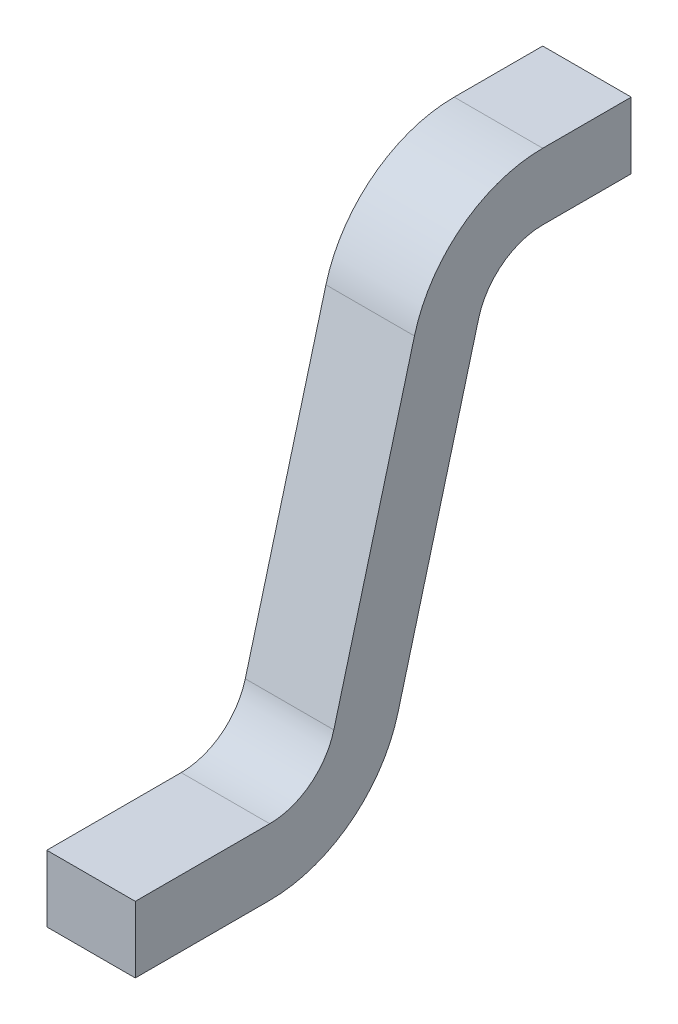
ISO-10303-21;
HEADER;
FILE_DESCRIPTION(('STEP AP214'),'2;1');
FILE_NAME('part.step','',(''),(''),'','','');
FILE_SCHEMA(('AUTOMOTIVE_DESIGN { 1 0 10303 214 1 1 1 1 }'));
ENDSEC;
DATA;
#1=APPLICATION_CONTEXT('core data for automotive mechanical design processes');
#2=APPLICATION_PROTOCOL_DEFINITION('international standard','automotive_design',2000,#1);
#3=PRODUCT_CONTEXT('',#1,'mechanical');
#4=PRODUCT('Part','Part','',(#3));
#5=PRODUCT_RELATED_PRODUCT_CATEGORY('part','',(#4));
#6=PRODUCT_DEFINITION_FORMATION('','',#4);
#7=PRODUCT_DEFINITION_CONTEXT('part definition',#1,'design');
#8=PRODUCT_DEFINITION('design','',#6,#7);
#9=PRODUCT_DEFINITION_SHAPE('','',#8);
#10=(LENGTH_UNIT() NAMED_UNIT(*) SI_UNIT(.MILLI.,.METRE.));
#11=(NAMED_UNIT(*) PLANE_ANGLE_UNIT() SI_UNIT($,.RADIAN.));
#12=(NAMED_UNIT(*) SI_UNIT($,.STERADIAN.) SOLID_ANGLE_UNIT());
#13=UNCERTAINTY_MEASURE_WITH_UNIT(LENGTH_MEASURE(1.E-05),#10,'distance_accuracy_value','');
#14=(GEOMETRIC_REPRESENTATION_CONTEXT(3) GLOBAL_UNCERTAINTY_ASSIGNED_CONTEXT((#13)) GLOBAL_UNIT_ASSIGNED_CONTEXT((#10,
#11,#12)) REPRESENTATION_CONTEXT('',''));
#15=CARTESIAN_POINT('',(0.,0.,0.));
#16=DIRECTION('',(0.,0.,1.));
#17=DIRECTION('',(1.,0.,0.));
#18=AXIS2_PLACEMENT_3D('',#15,#16,#17);
#19=CARTESIAN_POINT('',(-0.1,-1.01320558087763,-0.479564779095964));
#20=DIRECTION('',(-1.,0.,0.));
#21=DIRECTION('',(0.,1.,0.));
#22=AXIS2_PLACEMENT_3D('',#19,#20,#21);
#23=PLANE('',#22);
#24=DIRECTION('',(0.,0.,-1.));
#25=VECTOR('',#24,1.);
#26=CARTESIAN_POINT('',(-0.1,0.,0.8));
#27=LINE('',#26,#25);
#28=CARTESIAN_POINT('',(-0.1,0.,0.2));
#29=VERTEX_POINT('',#28);
#30=CARTESIAN_POINT('',(-0.1,0.,0.));
#31=VERTEX_POINT('',#30);
#32=EDGE_CURVE('E195',#29,#31,#27,.T.);
#33=ORIENTED_EDGE('',*,*,#32,.F.);
#34=CARTESIAN_POINT('',(-0.1,-0.15,0.2));
#35=DIRECTION('',(1.,0.,0.));
#36=DIRECTION('',(0.,0.,-1.));
#37=AXIS2_PLACEMENT_3D('',#34,#35,#36);
#38=CIRCLE('',#37,0.15);
#39=CARTESIAN_POINT('',(-0.1,-0.111177143234622,0.34488887394336));
#40=VERTEX_POINT('',#39);
#41=EDGE_CURVE('E199',#29,#40,#38,.T.);
#42=ORIENTED_EDGE('',*,*,#41,.T.);
#43=DIRECTION('',(0.,0.965925826289068,-0.258819045102521));
#44=VECTOR('',#43,1.);
#45=CARTESIAN_POINT('',(-0.1,-0.501073546521664,0.449361300335922));
#46=LINE('',#45,#44);
#47=CARTESIAN_POINT('',(-0.1,-0.790851294408385,0.527007013866678));
#48=VERTEX_POINT('',#47);
#49=EDGE_CURVE('E126',#48,#40,#46,.T.);
#50=ORIENTED_EDGE('',*,*,#49,.F.);
#51=CARTESIAN_POINT('',(-0.1,-0.713205580877628,0.816784761753399));
#52=DIRECTION('',(1.,0.,0.));
#53=DIRECTION('',(0.,-1.,0.));
#54=AXIS2_PLACEMENT_3D('',#51,#52,#53);
#55=CIRCLE('',#54,0.3);
#56=CARTESIAN_POINT('',(-0.1,-1.01320558087763,0.816784761753399));
#57=VERTEX_POINT('',#56);
#58=EDGE_CURVE('E125',#57,#48,#55,.T.);
#59=ORIENTED_EDGE('',*,*,#58,.F.);
#60=DIRECTION('',(0.,0.,-1.));
#61=VECTOR('',#60,1.);
#62=CARTESIAN_POINT('',(-0.1,-1.01320558087763,0.320435220904037));
#63=LINE('',#62,#61);
#64=CARTESIAN_POINT('',(-0.1,-1.01320558087763,1.12043522090404));
#65=VERTEX_POINT('',#64);
#66=EDGE_CURVE('E20',#65,#57,#63,.T.);
#67=ORIENTED_EDGE('',*,*,#66,.F.);
#68=DIRECTION('',(0.,-1.,0.));
#69=VECTOR('',#68,1.);
#70=CARTESIAN_POINT('',(-0.1,-1.01320558087763,1.12043522090404));
#71=LINE('',#70,#69);
#72=CARTESIAN_POINT('',(-0.1,-0.863205580877628,1.12043522090404));
#73=VERTEX_POINT('',#72);
#74=EDGE_CURVE('E158',#73,#65,#71,.T.);
#75=ORIENTED_EDGE('',*,*,#74,.F.);
#76=DIRECTION('',(0.,0.,1.));
#77=VECTOR('',#76,1.);
#78=CARTESIAN_POINT('',(-0.1,-0.863205580877628,0.320435220904037));
#79=LINE('',#78,#77);
#80=CARTESIAN_POINT('',(-0.1,-0.863205580877628,0.816784761753399));
#81=VERTEX_POINT('',#80);
#82=EDGE_CURVE('E157',#81,#73,#79,.T.);
#83=ORIENTED_EDGE('',*,*,#82,.F.);
#84=CARTESIAN_POINT('',(-0.1,-0.713205580877628,0.816784761753399));
#85=DIRECTION('',(1.,0.,0.));
#86=DIRECTION('',(0.,-1.,0.));
#87=AXIS2_PLACEMENT_3D('',#84,#85,#86);
#88=CIRCLE('',#87,0.15);
#89=CARTESIAN_POINT('',(-0.1,-0.752028437643006,0.671895887810039));
#90=VERTEX_POINT('',#89);
#91=EDGE_CURVE('E27',#81,#90,#88,.T.);
#92=ORIENTED_EDGE('',*,*,#91,.T.);
#93=DIRECTION('',(0.,-0.965925826289068,0.258819045102521));
#94=VECTOR('',#93,1.);
#95=CARTESIAN_POINT('',(-0.1,-0.462250689756285,0.594250174279283));
#96=LINE('',#95,#94);
#97=CARTESIAN_POINT('',(-0.1,-0.0723542864692436,0.489777747886721));
#98=VERTEX_POINT('',#97);
#99=EDGE_CURVE('E11',#98,#90,#96,.T.);
#100=ORIENTED_EDGE('',*,*,#99,.F.);
#101=CARTESIAN_POINT('',(-0.1,-0.15,0.2));
#102=DIRECTION('',(1.,0.,0.));
#103=DIRECTION('',(0.,0.,-1.));
#104=AXIS2_PLACEMENT_3D('',#101,#102,#103);
#105=CIRCLE('',#104,0.3);
#106=CARTESIAN_POINT('',(-0.1,0.15,0.2));
#107=VERTEX_POINT('',#106);
#108=EDGE_CURVE('E175',#107,#98,#105,.T.);
#109=ORIENTED_EDGE('',*,*,#108,.F.);
#110=DIRECTION('',(0.,0.,1.));
#111=VECTOR('',#110,1.);
#112=CARTESIAN_POINT('',(-0.1,0.15,0.8));
#113=LINE('',#112,#111);
#114=CARTESIAN_POINT('',(-0.1,0.15,0.));
#115=VERTEX_POINT('',#114);
#116=EDGE_CURVE('E177',#115,#107,#113,.T.);
#117=ORIENTED_EDGE('',*,*,#116,.F.);
#118=DIRECTION('',(0.,1.,0.));
#119=VECTOR('',#118,1.);
#120=CARTESIAN_POINT('',(-0.1,0.,0.));
#121=LINE('',#120,#119);
#122=EDGE_CURVE('E196',#31,#115,#121,.T.);
#123=ORIENTED_EDGE('',*,*,#122,.F.);
#124=EDGE_LOOP('',(#33,#42,#50,#59,#67,#75,#83,#92,#100,#109,#117,#123));
#125=FACE_BOUND('',#124,.T.);
#126=ADVANCED_FACE('F16',(#125),#23,.T.);
#127=CARTESIAN_POINT('',(0.,-0.462250689756285,0.594250174279283));
#128=DIRECTION('',(0.,0.258819045102521,0.965925826289068));
#129=DIRECTION('',(1.,0.,0.));
#130=AXIS2_PLACEMENT_3D('',#127,#128,#129);
#131=PLANE('',#130);
#132=DIRECTION('',(1.,0.,0.));
#133=VECTOR('',#132,1.);
#134=CARTESIAN_POINT('',(-0.297707469156736,-0.752028437643007,0.671895887810039));
#135=LINE('',#134,#133);
#136=CARTESIAN_POINT('',(0.1,-0.752028437643007,0.671895887810039));
#137=VERTEX_POINT('',#136);
#138=EDGE_CURVE('E258',#90,#137,#135,.T.);
#139=ORIENTED_EDGE('',*,*,#138,.T.);
#140=DIRECTION('',(0.,-0.965925826289068,0.258819045102521));
#141=VECTOR('',#140,1.);
#142=CARTESIAN_POINT('',(0.1,-0.0723542864692437,0.48977774788672));
#143=LINE('',#142,#141);
#144=CARTESIAN_POINT('',(0.1,-0.0723542864692436,0.48977774788672));
#145=VERTEX_POINT('',#144);
#146=EDGE_CURVE('E252',#145,#137,#143,.T.);
#147=ORIENTED_EDGE('',*,*,#146,.F.);
#148=DIRECTION('',(1.,0.,0.));
#149=VECTOR('',#148,1.);
#150=CARTESIAN_POINT('',(0.194661618624334,-0.0723542864692436,0.48977774788672));
#151=LINE('',#150,#149);
#152=EDGE_CURVE('E200',#98,#145,#151,.T.);
#153=ORIENTED_EDGE('',*,*,#152,.F.);
#154=ORIENTED_EDGE('',*,*,#99,.T.);
#155=EDGE_LOOP('',(#139,#147,#153,#154));
#156=FACE_BOUND('',#155,.T.);
#157=ADVANCED_FACE('F289',(#156),#131,.T.);
#158=CARTESIAN_POINT('',(-0.297707469156736,-0.713205580877628,0.816784761753399));
#159=DIRECTION('',(-1.,0.,0.));
#160=DIRECTION('',(0.,-1.,0.));
#161=AXIS2_PLACEMENT_3D('',#158,#159,#160);
#162=CYLINDRICAL_SURFACE('',#161,0.15);
#163=CARTESIAN_POINT('',(0.1,-0.713205580877628,0.816784761753399));
#164=DIRECTION('',(-1.,0.,0.));
#165=DIRECTION('',(0.,-1.,0.));
#166=AXIS2_PLACEMENT_3D('',#163,#164,#165);
#167=CIRCLE('',#166,0.15);
#168=CARTESIAN_POINT('',(0.1,-0.863205580877628,0.816784761753399));
#169=VERTEX_POINT('',#168);
#170=EDGE_CURVE('E208',#137,#169,#167,.T.);
#171=ORIENTED_EDGE('',*,*,#170,.F.);
#172=ORIENTED_EDGE('',*,*,#138,.F.);
#173=ORIENTED_EDGE('',*,*,#91,.F.);
#174=DIRECTION('',(-1.,0.,0.));
#175=VECTOR('',#174,1.);
#176=CARTESIAN_POINT('',(0.,-0.863205580877628,0.816784761753399));
#177=LINE('',#176,#175);
#178=EDGE_CURVE('E155',#169,#81,#177,.T.);
#179=ORIENTED_EDGE('',*,*,#178,.F.);
#180=EDGE_LOOP('',(#171,#172,#173,#179));
#181=FACE_BOUND('',#180,.T.);
#182=ADVANCED_FACE('F284',(#181),#162,.F.);
#183=CARTESIAN_POINT('',(0.,-0.863205580877628,0.320435220904037));
#184=DIRECTION('',(0.,1.,0.));
#185=DIRECTION('',(0.,0.,-1.));
#186=AXIS2_PLACEMENT_3D('',#183,#184,#185);
#187=PLANE('',#186);
#188=DIRECTION('',(-1.,0.,0.));
#189=VECTOR('',#188,1.);
#190=CARTESIAN_POINT('',(-0.1,-0.863205580877628,1.12043522090404));
#191=LINE('',#190,#189);
#192=CARTESIAN_POINT('',(0.1,-0.863205580877628,1.12043522090404));
#193=VERTEX_POINT('',#192);
#194=EDGE_CURVE('E169',#193,#73,#191,.T.);
#195=ORIENTED_EDGE('',*,*,#194,.F.);
#196=DIRECTION('',(0.,0.,1.));
#197=VECTOR('',#196,1.);
#198=CARTESIAN_POINT('',(0.1,-0.863205580877628,1.12043522090404));
#199=LINE('',#198,#197);
#200=EDGE_CURVE('E150',#169,#193,#199,.T.);
#201=ORIENTED_EDGE('',*,*,#200,.F.);
#202=ORIENTED_EDGE('',*,*,#178,.T.);
#203=ORIENTED_EDGE('',*,*,#82,.T.);
#204=EDGE_LOOP('',(#195,#201,#202,#203));
#205=FACE_BOUND('',#204,.T.);
#206=ADVANCED_FACE('F18',(#205),#187,.T.);
#207=CARTESIAN_POINT('',(-0.1,-1.01320558087763,1.12043522090404));
#208=DIRECTION('',(0.,0.,1.));
#209=DIRECTION('',(0.,-1.,0.));
#210=AXIS2_PLACEMENT_3D('',#207,#208,#209);
#211=PLANE('',#210);
#212=ORIENTED_EDGE('',*,*,#194,.T.);
#213=ORIENTED_EDGE('',*,*,#74,.T.);
#214=DIRECTION('',(-1.,0.,0.));
#215=VECTOR('',#214,1.);
#216=CARTESIAN_POINT('',(0.,-1.01320558087763,1.12043522090404));
#217=LINE('',#216,#215);
#218=CARTESIAN_POINT('',(0.1,-1.01320558087763,1.12043522090404));
#219=VERTEX_POINT('',#218);
#220=EDGE_CURVE('E104',#219,#65,#217,.T.);
#221=ORIENTED_EDGE('',*,*,#220,.F.);
#222=DIRECTION('',(0.,-1.,0.));
#223=VECTOR('',#222,1.);
#224=CARTESIAN_POINT('',(0.1,-1.01320558087763,1.12043522090404));
#225=LINE('',#224,#223);
#226=EDGE_CURVE('E142',#193,#219,#225,.T.);
#227=ORIENTED_EDGE('',*,*,#226,.F.);
#228=EDGE_LOOP('',(#212,#213,#221,#227));
#229=FACE_BOUND('',#228,.T.);
#230=ADVANCED_FACE('F310',(#229),#211,.T.);
#231=CARTESIAN_POINT('',(0.,-1.01320558087763,0.320435220904037));
#232=DIRECTION('',(0.,-1.,0.));
#233=DIRECTION('',(0.,0.,-1.));
#234=AXIS2_PLACEMENT_3D('',#231,#232,#233);
#235=PLANE('',#234);
#236=ORIENTED_EDGE('',*,*,#220,.T.);
#237=ORIENTED_EDGE('',*,*,#66,.T.);
#238=DIRECTION('',(-1.,0.,0.));
#239=VECTOR('',#238,1.);
#240=CARTESIAN_POINT('',(-0.297707469156736,-1.01320558087763,0.816784761753399));
#241=LINE('',#240,#239);
#242=CARTESIAN_POINT('',(0.1,-1.01320558087763,0.816784761753399));
#243=VERTEX_POINT('',#242);
#244=EDGE_CURVE('E113',#243,#57,#241,.T.);
#245=ORIENTED_EDGE('',*,*,#244,.F.);
#246=DIRECTION('',(0.,0.,-1.));
#247=VECTOR('',#246,1.);
#248=CARTESIAN_POINT('',(0.1,-1.01320558087763,1.12043522090404));
#249=LINE('',#248,#247);
#250=EDGE_CURVE('E117',#219,#243,#249,.T.);
#251=ORIENTED_EDGE('',*,*,#250,.F.);
#252=EDGE_LOOP('',(#236,#237,#245,#251));
#253=FACE_BOUND('',#252,.T.);
#254=ADVANCED_FACE('F115',(#253),#235,.T.);
#255=CARTESIAN_POINT('',(-0.297707469156736,-0.713205580877628,0.816784761753399));
#256=DIRECTION('',(-1.,0.,0.));
#257=DIRECTION('',(0.,-1.,0.));
#258=AXIS2_PLACEMENT_3D('',#255,#256,#257);
#259=CYLINDRICAL_SURFACE('',#258,0.3);
#260=DIRECTION('',(-1.,0.,0.));
#261=VECTOR('',#260,1.);
#262=CARTESIAN_POINT('',(0.,-0.790851294408385,0.527007013866679));
#263=LINE('',#262,#261);
#264=CARTESIAN_POINT('',(0.1,-0.790851294408385,0.527007013866679));
#265=VERTEX_POINT('',#264);
#266=EDGE_CURVE('E132',#265,#48,#263,.T.);
#267=ORIENTED_EDGE('',*,*,#266,.F.);
#268=CARTESIAN_POINT('',(0.1,-0.713205580877628,0.816784761753399));
#269=DIRECTION('',(1.,0.,0.));
#270=DIRECTION('',(0.,-1.,0.));
#271=AXIS2_PLACEMENT_3D('',#268,#269,#270);
#272=CIRCLE('',#271,0.3);
#273=EDGE_CURVE('E129',#243,#265,#272,.T.);
#274=ORIENTED_EDGE('',*,*,#273,.F.);
#275=ORIENTED_EDGE('',*,*,#244,.T.);
#276=ORIENTED_EDGE('',*,*,#58,.T.);
#277=EDGE_LOOP('',(#267,#274,#275,#276));
#278=FACE_BOUND('',#277,.T.);
#279=ADVANCED_FACE('F130',(#278),#259,.T.);
#280=CARTESIAN_POINT('',(0.,-0.501073546521664,0.449361300335922));
#281=DIRECTION('',(0.,-0.258819045102521,-0.965925826289068));
#282=DIRECTION('',(0.,-0.965925826289068,0.258819045102521));
#283=AXIS2_PLACEMENT_3D('',#280,#281,#282);
#284=PLANE('',#283);
#285=ORIENTED_EDGE('',*,*,#266,.T.);
#286=ORIENTED_EDGE('',*,*,#49,.T.);
#287=DIRECTION('',(1.,0.,0.));
#288=VECTOR('',#287,1.);
#289=CARTESIAN_POINT('',(0.194661618624334,-0.111177143234622,0.34488887394336));
#290=LINE('',#289,#288);
#291=CARTESIAN_POINT('',(0.1,-0.111177143234622,0.34488887394336));
#292=VERTEX_POINT('',#291);
#293=EDGE_CURVE('E203',#40,#292,#290,.T.);
#294=ORIENTED_EDGE('',*,*,#293,.T.);
#295=DIRECTION('',(0.,0.965925826289068,-0.258819045102521));
#296=VECTOR('',#295,1.);
#297=CARTESIAN_POINT('',(0.1,-0.790851294408385,0.527007013866679));
#298=LINE('',#297,#296);
#299=EDGE_CURVE('E137',#265,#292,#298,.T.);
#300=ORIENTED_EDGE('',*,*,#299,.F.);
#301=EDGE_LOOP('',(#285,#286,#294,#300));
#302=FACE_BOUND('',#301,.T.);
#303=ADVANCED_FACE('F313',(#302),#284,.T.);
#304=CARTESIAN_POINT('',(0.194661618624334,-0.15,0.2));
#305=DIRECTION('',(1.,0.,0.));
#306=DIRECTION('',(0.,0.,-1.));
#307=AXIS2_PLACEMENT_3D('',#304,#305,#306);
#308=CYLINDRICAL_SURFACE('',#307,0.15);
#309=ORIENTED_EDGE('',*,*,#41,.F.);
#310=DIRECTION('',(-1.,0.,0.));
#311=VECTOR('',#310,1.);
#312=CARTESIAN_POINT('',(0.,0.,0.2));
#313=LINE('',#312,#311);
#314=CARTESIAN_POINT('',(0.1,0.,0.2));
#315=VERTEX_POINT('',#314);
#316=EDGE_CURVE('E191',#315,#29,#313,.T.);
#317=ORIENTED_EDGE('',*,*,#316,.F.);
#318=CARTESIAN_POINT('',(0.1,-0.15,0.2));
#319=DIRECTION('',(-1.,0.,0.));
#320=DIRECTION('',(0.,0.,-1.));
#321=AXIS2_PLACEMENT_3D('',#318,#319,#320);
#322=CIRCLE('',#321,0.15);
#323=EDGE_CURVE('E183',#292,#315,#322,.T.);
#324=ORIENTED_EDGE('',*,*,#323,.F.);
#325=ORIENTED_EDGE('',*,*,#293,.F.);
#326=EDGE_LOOP('',(#309,#317,#324,#325));
#327=FACE_BOUND('',#326,.T.);
#328=ADVANCED_FACE('F316',(#327),#308,.F.);
#329=CARTESIAN_POINT('',(0.,0.,0.8));
#330=DIRECTION('',(0.,-1.,0.));
#331=DIRECTION('',(0.,0.,-1.));
#332=AXIS2_PLACEMENT_3D('',#329,#330,#331);
#333=PLANE('',#332);
#334=DIRECTION('',(-1.,0.,0.));
#335=VECTOR('',#334,1.);
#336=CARTESIAN_POINT('',(0.1,0.,0.));
#337=LINE('',#336,#335);
#338=CARTESIAN_POINT('',(0.1,0.,0.));
#339=VERTEX_POINT('',#338);
#340=EDGE_CURVE('E181',#339,#31,#337,.T.);
#341=ORIENTED_EDGE('',*,*,#340,.F.);
#342=DIRECTION('',(0.,0.,-1.));
#343=VECTOR('',#342,1.);
#344=CARTESIAN_POINT('',(0.1,0.,1.12043522090404));
#345=LINE('',#344,#343);
#346=EDGE_CURVE('E187',#315,#339,#345,.T.);
#347=ORIENTED_EDGE('',*,*,#346,.F.);
#348=ORIENTED_EDGE('',*,*,#316,.T.);
#349=ORIENTED_EDGE('',*,*,#32,.T.);
#350=EDGE_LOOP('',(#341,#347,#348,#349));
#351=FACE_BOUND('',#350,.T.);
#352=ADVANCED_FACE('F318',(#351),#333,.T.);
#353=CARTESIAN_POINT('',(0.1,0.,0.));
#354=DIRECTION('',(0.,0.,-1.));
#355=DIRECTION('',(-1.,0.,0.));
#356=AXIS2_PLACEMENT_3D('',#353,#354,#355);
#357=PLANE('',#356);
#358=DIRECTION('',(-1.,0.,0.));
#359=VECTOR('',#358,1.);
#360=CARTESIAN_POINT('',(0.,0.15,0.));
#361=LINE('',#360,#359);
#362=CARTESIAN_POINT('',(0.1,0.15,0.));
#363=VERTEX_POINT('',#362);
#364=EDGE_CURVE('E182',#363,#115,#361,.T.);
#365=ORIENTED_EDGE('',*,*,#364,.F.);
#366=DIRECTION('',(0.,1.,0.));
#367=VECTOR('',#366,1.);
#368=CARTESIAN_POINT('',(0.1,-1.01320558087763,0.));
#369=LINE('',#368,#367);
#370=EDGE_CURVE('E176',#339,#363,#369,.T.);
#371=ORIENTED_EDGE('',*,*,#370,.F.);
#372=ORIENTED_EDGE('',*,*,#340,.T.);
#373=ORIENTED_EDGE('',*,*,#122,.T.);
#374=EDGE_LOOP('',(#365,#371,#372,#373));
#375=FACE_BOUND('',#374,.T.);
#376=ADVANCED_FACE('F227',(#375),#357,.T.);
#377=CARTESIAN_POINT('',(0.,0.15,0.8));
#378=DIRECTION('',(0.,1.,0.));
#379=DIRECTION('',(1.,0.,0.));
#380=AXIS2_PLACEMENT_3D('',#377,#378,#379);
#381=PLANE('',#380);
#382=ORIENTED_EDGE('',*,*,#364,.T.);
#383=ORIENTED_EDGE('',*,*,#116,.T.);
#384=DIRECTION('',(-1.,0.,0.));
#385=VECTOR('',#384,1.);
#386=CARTESIAN_POINT('',(0.194661618624334,0.15,0.2));
#387=LINE('',#386,#385);
#388=CARTESIAN_POINT('',(0.1,0.15,0.2));
#389=VERTEX_POINT('',#388);
#390=EDGE_CURVE('E172',#389,#107,#387,.T.);
#391=ORIENTED_EDGE('',*,*,#390,.F.);
#392=DIRECTION('',(0.,0.,1.));
#393=VECTOR('',#392,1.);
#394=CARTESIAN_POINT('',(0.1,0.15,1.12043522090404));
#395=LINE('',#394,#393);
#396=EDGE_CURVE('E223',#363,#389,#395,.T.);
#397=ORIENTED_EDGE('',*,*,#396,.F.);
#398=EDGE_LOOP('',(#382,#383,#391,#397));
#399=FACE_BOUND('',#398,.T.);
#400=ADVANCED_FACE('F218',(#399),#381,.T.);
#401=CARTESIAN_POINT('',(0.194661618624334,-0.15,0.2));
#402=DIRECTION('',(1.,0.,0.));
#403=DIRECTION('',(0.,0.,-1.));
#404=AXIS2_PLACEMENT_3D('',#401,#402,#403);
#405=CYLINDRICAL_SURFACE('',#404,0.3);
#406=ORIENTED_EDGE('',*,*,#390,.T.);
#407=ORIENTED_EDGE('',*,*,#108,.T.);
#408=ORIENTED_EDGE('',*,*,#152,.T.);
#409=CARTESIAN_POINT('',(0.1,-0.15,0.2));
#410=DIRECTION('',(1.,0.,0.));
#411=DIRECTION('',(0.,0.,-1.));
#412=AXIS2_PLACEMENT_3D('',#409,#410,#411);
#413=CIRCLE('',#412,0.3);
#414=EDGE_CURVE('E255',#389,#145,#413,.T.);
#415=ORIENTED_EDGE('',*,*,#414,.F.);
#416=EDGE_LOOP('',(#406,#407,#408,#415));
#417=FACE_BOUND('',#416,.T.);
#418=ADVANCED_FACE('F293',(#417),#405,.T.);
#419=CARTESIAN_POINT('',(0.1,-1.01320558087763,1.12043522090404));
#420=DIRECTION('',(1.,0.,0.));
#421=DIRECTION('',(0.,0.,-1.));
#422=AXIS2_PLACEMENT_3D('',#419,#420,#421);
#423=PLANE('',#422);
#424=ORIENTED_EDGE('',*,*,#396,.T.);
#425=ORIENTED_EDGE('',*,*,#414,.T.);
#426=ORIENTED_EDGE('',*,*,#146,.T.);
#427=ORIENTED_EDGE('',*,*,#170,.T.);
#428=ORIENTED_EDGE('',*,*,#200,.T.);
#429=ORIENTED_EDGE('',*,*,#226,.T.);
#430=ORIENTED_EDGE('',*,*,#250,.T.);
#431=ORIENTED_EDGE('',*,*,#273,.T.);
#432=ORIENTED_EDGE('',*,*,#299,.T.);
#433=ORIENTED_EDGE('',*,*,#323,.T.);
#434=ORIENTED_EDGE('',*,*,#346,.T.);
#435=ORIENTED_EDGE('',*,*,#370,.T.);
#436=EDGE_LOOP('',(#424,#425,#426,#427,#428,#429,#430,#431,#432,#433,#434,#435));
#437=FACE_BOUND('',#436,.T.);
#438=ADVANCED_FACE('F140',(#437),#423,.T.);
#439=CLOSED_SHELL('',(#126,#157,#182,#206,#230,#254,#279,#303,#328,#352,#376,#400,#418,#438));
#440=MANIFOLD_SOLID_BREP('B1',#439);
#441=ADVANCED_BREP_SHAPE_REPRESENTATION('',(#18,#440),#14);
#442=SHAPE_DEFINITION_REPRESENTATION(#9,#441);
ENDSEC;
END-ISO-10303-21;
